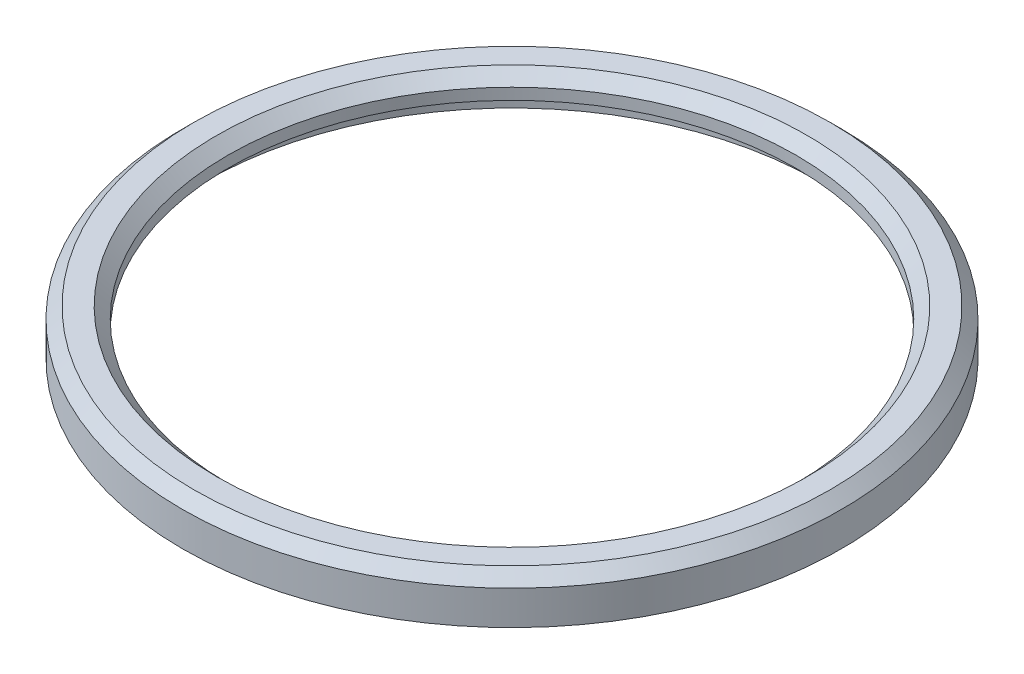
ISO-10303-21;
HEADER;
FILE_DESCRIPTION(('STEP AP214'),'2;1');
FILE_NAME('part.step','',(''),(''),'','','');
FILE_SCHEMA(('AUTOMOTIVE_DESIGN { 1 0 10303 214 1 1 1 1 }'));
ENDSEC;
DATA;
#1=APPLICATION_CONTEXT('core data for automotive mechanical design processes');
#2=APPLICATION_PROTOCOL_DEFINITION('international standard','automotive_design',2000,#1);
#3=PRODUCT_CONTEXT('',#1,'mechanical');
#4=PRODUCT('Part','Part','',(#3));
#5=PRODUCT_RELATED_PRODUCT_CATEGORY('part','',(#4));
#6=PRODUCT_DEFINITION_FORMATION('','',#4);
#7=PRODUCT_DEFINITION_CONTEXT('part definition',#1,'design');
#8=PRODUCT_DEFINITION('design','',#6,#7);
#9=PRODUCT_DEFINITION_SHAPE('','',#8);
#10=(LENGTH_UNIT() NAMED_UNIT(*) SI_UNIT(.MILLI.,.METRE.));
#11=(NAMED_UNIT(*) PLANE_ANGLE_UNIT() SI_UNIT($,.RADIAN.));
#12=(NAMED_UNIT(*) SI_UNIT($,.STERADIAN.) SOLID_ANGLE_UNIT());
#13=UNCERTAINTY_MEASURE_WITH_UNIT(LENGTH_MEASURE(1.E-05),#10,'distance_accuracy_value','');
#14=(GEOMETRIC_REPRESENTATION_CONTEXT(3) GLOBAL_UNCERTAINTY_ASSIGNED_CONTEXT((#13)) GLOBAL_UNIT_ASSIGNED_CONTEXT((#10,
#11,#12)) REPRESENTATION_CONTEXT('',''));
#15=CARTESIAN_POINT('',(0.,0.,0.));
#16=DIRECTION('',(0.,0.,1.));
#17=DIRECTION('',(1.,0.,0.));
#18=AXIS2_PLACEMENT_3D('',#15,#16,#17);
#19=CARTESIAN_POINT('',(0.,2.,0.));
#20=DIRECTION('',(0.,-1.,0.));
#21=DIRECTION('',(0.,0.,-1.));
#22=AXIS2_PLACEMENT_3D('',#19,#20,#21);
#23=CYLINDRICAL_SURFACE('',#22,12.5);
#24=CARTESIAN_POINT('',(0.,1.5,0.));
#25=DIRECTION('',(0.,1.,0.));
#26=DIRECTION('',(0.,0.,1.));
#27=AXIS2_PLACEMENT_3D('',#24,#25,#26);
#28=CIRCLE('',#27,12.5);
#29=CARTESIAN_POINT('',(0.,1.5,12.5));
#30=VERTEX_POINT('',#29);
#31=EDGE_CURVE('E45',#30,#30,#28,.T.);
#32=ORIENTED_EDGE('',*,*,#31,.T.);
#33=EDGE_LOOP('',(#32));
#34=FACE_BOUND('',#33,.T.);
#35=CARTESIAN_POINT('',(0.,1.,0.));
#36=DIRECTION('',(0.,-1.,0.));
#37=DIRECTION('',(0.,0.,-1.));
#38=AXIS2_PLACEMENT_3D('',#35,#36,#37);
#39=CIRCLE('',#38,12.5);
#40=CARTESIAN_POINT('',(0.,1.,-12.5));
#41=VERTEX_POINT('',#40);
#42=EDGE_CURVE('E51',#41,#41,#39,.T.);
#43=ORIENTED_EDGE('',*,*,#42,.T.);
#44=EDGE_LOOP('',(#43));
#45=FACE_BOUND('',#44,.T.);
#46=ADVANCED_FACE('F30',(#34,#45),#23,.F.);
#47=CARTESIAN_POINT('',(0.,2.,0.));
#48=DIRECTION('',(0.,1.,0.));
#49=DIRECTION('',(0.,0.,1.));
#50=AXIS2_PLACEMENT_3D('',#47,#48,#49);
#51=PLANE('',#50);
#52=CARTESIAN_POINT('',(0.,2.,0.));
#53=DIRECTION('',(0.,1.,0.));
#54=DIRECTION('',(0.,0.,1.));
#55=AXIS2_PLACEMENT_3D('',#52,#53,#54);
#56=CIRCLE('',#55,13.);
#57=CARTESIAN_POINT('',(0.,2.,13.));
#58=VERTEX_POINT('',#57);
#59=EDGE_CURVE('E37',#58,#58,#56,.F.);
#60=ORIENTED_EDGE('',*,*,#59,.T.);
#61=EDGE_LOOP('',(#60));
#62=FACE_BOUND('',#61,.T.);
#63=CARTESIAN_POINT('',(0.,2.,0.));
#64=DIRECTION('',(0.,1.,0.));
#65=DIRECTION('',(0.,0.,1.));
#66=AXIS2_PLACEMENT_3D('',#63,#64,#65);
#67=CIRCLE('',#66,14.);
#68=CARTESIAN_POINT('',(0.,2.,14.));
#69=VERTEX_POINT('',#68);
#70=EDGE_CURVE('E41',#69,#69,#67,.T.);
#71=ORIENTED_EDGE('',*,*,#70,.T.);
#72=EDGE_LOOP('',(#71));
#73=FACE_BOUND('',#72,.T.);
#74=ADVANCED_FACE('F75',(#62,#73),#51,.T.);
#75=CARTESIAN_POINT('',(0.,0.,0.));
#76=DIRECTION('',(0.,1.,0.));
#77=DIRECTION('',(0.,0.,1.));
#78=AXIS2_PLACEMENT_3D('',#75,#76,#77);
#79=PLANE('',#78);
#80=CARTESIAN_POINT('',(0.,0.,0.));
#81=DIRECTION('',(0.,-1.,0.));
#82=DIRECTION('',(0.,0.,-1.));
#83=AXIS2_PLACEMENT_3D('',#80,#81,#82);
#84=CIRCLE('',#83,13.5);
#85=CARTESIAN_POINT('',(0.,0.,-13.5));
#86=VERTEX_POINT('',#85);
#87=EDGE_CURVE('E57',#86,#86,#84,.T.);
#88=ORIENTED_EDGE('',*,*,#87,.F.);
#89=EDGE_LOOP('',(#88));
#90=FACE_BOUND('',#89,.T.);
#91=CARTESIAN_POINT('',(0.,0.,0.));
#92=DIRECTION('',(0.,1.,0.));
#93=DIRECTION('',(0.,0.,1.));
#94=AXIS2_PLACEMENT_3D('',#91,#92,#93);
#95=CIRCLE('',#94,14.5);
#96=CARTESIAN_POINT('',(0.,0.,14.5));
#97=VERTEX_POINT('',#96);
#98=EDGE_CURVE('E50',#97,#97,#95,.T.);
#99=ORIENTED_EDGE('',*,*,#98,.F.);
#100=EDGE_LOOP('',(#99));
#101=FACE_BOUND('',#100,.T.);
#102=ADVANCED_FACE('F72',(#90,#101),#79,.F.);
#103=CARTESIAN_POINT('',(0.,2.,0.));
#104=DIRECTION('',(0.,-1.,0.));
#105=DIRECTION('',(0.,0.,-1.));
#106=AXIS2_PLACEMENT_3D('',#103,#104,#105);
#107=CYLINDRICAL_SURFACE('',#106,14.5);
#108=CARTESIAN_POINT('',(0.,1.50000000000001,0.));
#109=DIRECTION('',(0.,1.,0.));
#110=DIRECTION('',(0.,0.,1.));
#111=AXIS2_PLACEMENT_3D('',#108,#109,#110);
#112=CIRCLE('',#111,14.5);
#113=CARTESIAN_POINT('',(0.,1.50000000000001,14.5));
#114=VERTEX_POINT('',#113);
#115=EDGE_CURVE('E10',#114,#114,#112,.F.);
#116=ORIENTED_EDGE('',*,*,#115,.T.);
#117=EDGE_LOOP('',(#116));
#118=FACE_BOUND('',#117,.T.);
#119=ORIENTED_EDGE('',*,*,#98,.T.);
#120=EDGE_LOOP('',(#119));
#121=FACE_BOUND('',#120,.T.);
#122=ADVANCED_FACE('F68',(#118,#121),#107,.T.);
#123=CARTESIAN_POINT('',(0.,1.,0.));
#124=DIRECTION('',(0.,-1.,0.));
#125=DIRECTION('',(0.,0.,-1.));
#126=AXIS2_PLACEMENT_3D('',#123,#124,#125);
#127=CYLINDRICAL_SURFACE('',#126,13.5);
#128=CARTESIAN_POINT('',(0.,1.,0.));
#129=DIRECTION('',(0.,-1.,0.));
#130=DIRECTION('',(0.,0.,-1.));
#131=AXIS2_PLACEMENT_3D('',#128,#129,#130);
#132=CIRCLE('',#131,13.5);
#133=CARTESIAN_POINT('',(0.,1.,-13.5));
#134=VERTEX_POINT('',#133);
#135=EDGE_CURVE('E54',#134,#134,#132,.T.);
#136=ORIENTED_EDGE('',*,*,#135,.F.);
#137=EDGE_LOOP('',(#136));
#138=FACE_BOUND('',#137,.T.);
#139=ORIENTED_EDGE('',*,*,#87,.T.);
#140=EDGE_LOOP('',(#139));
#141=FACE_BOUND('',#140,.T.);
#142=ADVANCED_FACE('F65',(#138,#141),#127,.F.);
#143=CARTESIAN_POINT('',(0.,1.,0.));
#144=DIRECTION('',(0.,-1.,0.));
#145=DIRECTION('',(0.,0.,-1.));
#146=AXIS2_PLACEMENT_3D('',#143,#144,#145);
#147=PLANE('',#146);
#148=ORIENTED_EDGE('',*,*,#42,.F.);
#149=EDGE_LOOP('',(#148));
#150=FACE_BOUND('',#149,.T.);
#151=ORIENTED_EDGE('',*,*,#135,.T.);
#152=EDGE_LOOP('',(#151));
#153=FACE_BOUND('',#152,.T.);
#154=ADVANCED_FACE('F63',(#150,#153),#147,.T.);
#155=CARTESIAN_POINT('',(0.,1.5,0.));
#156=DIRECTION('',(0.,1.,0.));
#157=DIRECTION('',(0.,0.,1.));
#158=AXIS2_PLACEMENT_3D('',#155,#156,#157);
#159=CONICAL_SURFACE('',#158,12.5,0.78539816339745);
#160=ORIENTED_EDGE('',*,*,#59,.F.);
#161=EDGE_LOOP('',(#160));
#162=FACE_BOUND('',#161,.T.);
#163=ORIENTED_EDGE('',*,*,#31,.F.);
#164=EDGE_LOOP('',(#163));
#165=FACE_BOUND('',#164,.T.);
#166=ADVANCED_FACE('F93',(#162,#165),#159,.F.);
#167=CARTESIAN_POINT('',(0.,2.,0.));
#168=DIRECTION('',(0.,-1.,0.));
#169=DIRECTION('',(0.,0.,-1.));
#170=AXIS2_PLACEMENT_3D('',#167,#168,#169);
#171=CONICAL_SURFACE('',#170,14.,0.785398163397452);
#172=ORIENTED_EDGE('',*,*,#115,.F.);
#173=EDGE_LOOP('',(#172));
#174=FACE_BOUND('',#173,.T.);
#175=ORIENTED_EDGE('',*,*,#70,.F.);
#176=EDGE_LOOP('',(#175));
#177=FACE_BOUND('',#176,.T.);
#178=ADVANCED_FACE('F32',(#174,#177),#171,.T.);
#179=CLOSED_SHELL('',(#46,#74,#102,#122,#142,#154,#166,#178));
#180=MANIFOLD_SOLID_BREP('B2',#179);
#181=ADVANCED_BREP_SHAPE_REPRESENTATION('',(#18,#180),#14);
#182=SHAPE_DEFINITION_REPRESENTATION(#9,#181);
ENDSEC;
END-ISO-10303-21;
